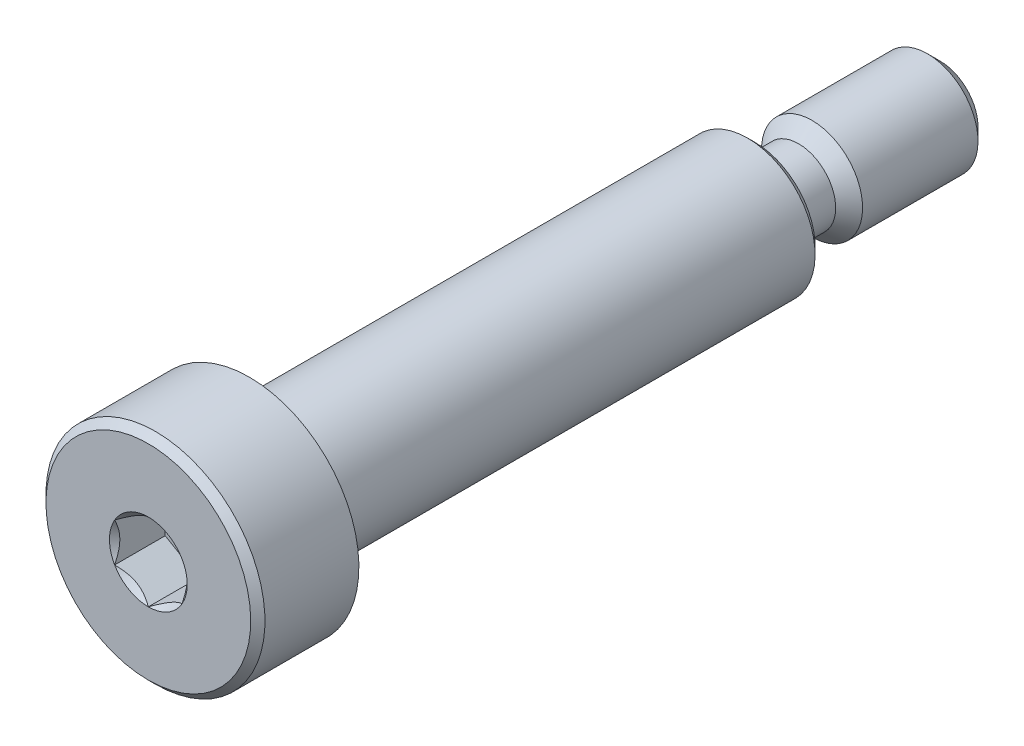
ISO-10303-21;
HEADER;
FILE_DESCRIPTION(('STEP AP214'),'2;1');
FILE_NAME('part.step','',(''),(''),'','','');
FILE_SCHEMA(('AUTOMOTIVE_DESIGN { 1 0 10303 214 1 1 1 1 }'));
ENDSEC;
DATA;
#1=APPLICATION_CONTEXT('core data for automotive mechanical design processes');
#2=APPLICATION_PROTOCOL_DEFINITION('international standard','automotive_design',2000,#1);
#3=PRODUCT_CONTEXT('',#1,'mechanical');
#4=PRODUCT('Part','Part','',(#3));
#5=PRODUCT_RELATED_PRODUCT_CATEGORY('part','',(#4));
#6=PRODUCT_DEFINITION_FORMATION('','',#4);
#7=PRODUCT_DEFINITION_CONTEXT('part definition',#1,'design');
#8=PRODUCT_DEFINITION('design','',#6,#7);
#9=PRODUCT_DEFINITION_SHAPE('','',#8);
#10=(LENGTH_UNIT() NAMED_UNIT(*) SI_UNIT(.MILLI.,.METRE.));
#11=(NAMED_UNIT(*) PLANE_ANGLE_UNIT() SI_UNIT($,.RADIAN.));
#12=(NAMED_UNIT(*) SI_UNIT($,.STERADIAN.) SOLID_ANGLE_UNIT());
#13=UNCERTAINTY_MEASURE_WITH_UNIT(LENGTH_MEASURE(1.E-05),#10,'distance_accuracy_value','');
#14=(GEOMETRIC_REPRESENTATION_CONTEXT(3) GLOBAL_UNCERTAINTY_ASSIGNED_CONTEXT((#13)) GLOBAL_UNIT_ASSIGNED_CONTEXT((#10,
#11,#12)) REPRESENTATION_CONTEXT('',''));
#15=CARTESIAN_POINT('',(0.,0.,0.));
#16=DIRECTION('',(0.,0.,1.));
#17=DIRECTION('',(1.,0.,0.));
#18=AXIS2_PLACEMENT_3D('',#15,#16,#17);
#19=CARTESIAN_POINT('',(0.,0.,-23.5));
#20=DIRECTION('',(0.,0.,-1.));
#21=DIRECTION('',(0.,1.,0.));
#22=AXIS2_PLACEMENT_3D('',#19,#20,#21);
#23=CYLINDRICAL_SURFACE('',#22,4.);
#24=CARTESIAN_POINT('',(0.,0.,-12.0775));
#25=DIRECTION('',(0.,0.,-1.));
#26=DIRECTION('',(0.,1.,0.));
#27=AXIS2_PLACEMENT_3D('',#24,#25,#26);
#28=CIRCLE('',#27,4.);
#29=CARTESIAN_POINT('',(0.,4.,-12.0775));
#30=VERTEX_POINT('',#29);
#31=EDGE_CURVE('E264',#30,#30,#28,.F.);
#32=ORIENTED_EDGE('',*,*,#31,.T.);
#33=EDGE_LOOP('',(#32));
#34=FACE_BOUND('',#33,.T.);
#35=CARTESIAN_POINT('',(0.,0.,16.3733333333333));
#36=DIRECTION('',(0.,0.,-1.));
#37=DIRECTION('',(0.,1.,0.));
#38=AXIS2_PLACEMENT_3D('',#35,#36,#37);
#39=CIRCLE('',#38,4.);
#40=CARTESIAN_POINT('',(0.,4.,16.3733333333333));
#41=VERTEX_POINT('',#40);
#42=EDGE_CURVE('E292',#41,#41,#39,.T.);
#43=ORIENTED_EDGE('',*,*,#42,.T.);
#44=EDGE_LOOP('',(#43));
#45=FACE_BOUND('',#44,.T.);
#46=ADVANCED_FACE('F47',(#34,#45),#23,.T.);
#47=CARTESIAN_POINT('',(0.,-4.,-12.5));
#48=DIRECTION('',(0.,0.,-1.));
#49=DIRECTION('',(0.,1.,0.));
#50=AXIS2_PLACEMENT_3D('',#47,#48,#49);
#51=PLANE('',#50);
#52=CARTESIAN_POINT('',(0.,0.,-12.5));
#53=DIRECTION('',(0.,0.,-1.));
#54=DIRECTION('',(0.,1.,0.));
#55=AXIS2_PLACEMENT_3D('',#52,#53,#54);
#56=CIRCLE('',#55,3.57750000000001);
#57=CARTESIAN_POINT('',(0.,3.57750000000001,-12.5));
#58=VERTEX_POINT('',#57);
#59=EDGE_CURVE('E267',#58,#58,#56,.T.);
#60=ORIENTED_EDGE('',*,*,#59,.T.);
#61=EDGE_LOOP('',(#60));
#62=FACE_BOUND('',#61,.T.);
#63=CARTESIAN_POINT('',(0.,0.,-12.5));
#64=DIRECTION('',(0.,0.,-1.));
#65=DIRECTION('',(0.,1.,0.));
#66=AXIS2_PLACEMENT_3D('',#63,#64,#65);
#67=CIRCLE('',#66,3.);
#68=CARTESIAN_POINT('',(0.,3.,-12.5));
#69=VERTEX_POINT('',#68);
#70=EDGE_CURVE('E318',#69,#69,#67,.T.);
#71=ORIENTED_EDGE('',*,*,#70,.F.);
#72=EDGE_LOOP('',(#71));
#73=FACE_BOUND('',#72,.T.);
#74=ADVANCED_FACE('F217',(#62,#73),#51,.T.);
#75=CARTESIAN_POINT('',(0.,0.,-23.5));
#76=DIRECTION('',(0.,0.,-1.));
#77=DIRECTION('',(0.,1.,0.));
#78=AXIS2_PLACEMENT_3D('',#75,#76,#77);
#79=CYLINDRICAL_SURFACE('',#78,3.13333333333333);
#80=CARTESIAN_POINT('',(0.,0.,16.8933333333333));
#81=DIRECTION('',(0.,0.,-1.));
#82=DIRECTION('',(0.,1.,0.));
#83=AXIS2_PLACEMENT_3D('',#80,#81,#82);
#84=CIRCLE('',#83,3.13333333333333);
#85=CARTESIAN_POINT('',(0.,3.13333333333333,16.8933333333333));
#86=VERTEX_POINT('',#85);
#87=EDGE_CURVE('E312',#86,#86,#84,.F.);
#88=ORIENTED_EDGE('',*,*,#87,.T.);
#89=EDGE_LOOP('',(#88));
#90=FACE_BOUND('',#89,.T.);
#91=CARTESIAN_POINT('',(0.,0.,17.5));
#92=DIRECTION('',(0.,0.,-1.));
#93=DIRECTION('',(0.,1.,0.));
#94=AXIS2_PLACEMENT_3D('',#91,#92,#93);
#95=CIRCLE('',#94,3.13333333333333);
#96=CARTESIAN_POINT('',(0.,3.13333333333333,17.5));
#97=VERTEX_POINT('',#96);
#98=EDGE_CURVE('E293',#97,#97,#95,.T.);
#99=ORIENTED_EDGE('',*,*,#98,.T.);
#100=EDGE_LOOP('',(#99));
#101=FACE_BOUND('',#100,.T.);
#102=ADVANCED_FACE('F224',(#90,#101),#79,.T.);
#103=CARTESIAN_POINT('',(0.,3.99999999999999,16.6333333333333));
#104=DIRECTION('',(0.,0.,-1.));
#105=DIRECTION('',(0.,1.,0.));
#106=AXIS2_PLACEMENT_3D('',#103,#104,#105);
#107=PLANE('',#106);
#108=CARTESIAN_POINT('',(0.,0.,16.6333333333333));
#109=DIRECTION('',(0.,0.,-1.));
#110=DIRECTION('',(0.,1.,0.));
#111=AXIS2_PLACEMENT_3D('',#108,#109,#110);
#112=CIRCLE('',#111,3.74000000000001);
#113=CARTESIAN_POINT('',(0.,3.74,16.6333333333333));
#114=VERTEX_POINT('',#113);
#115=EDGE_CURVE('E308',#114,#114,#112,.F.);
#116=ORIENTED_EDGE('',*,*,#115,.T.);
#117=EDGE_LOOP('',(#116));
#118=FACE_BOUND('',#117,.T.);
#119=CARTESIAN_POINT('',(0.,0.,16.6333333333333));
#120=DIRECTION('',(0.,0.,-1.));
#121=DIRECTION('',(0.,1.,0.));
#122=AXIS2_PLACEMENT_3D('',#119,#120,#121);
#123=CIRCLE('',#122,3.39333333333332);
#124=CARTESIAN_POINT('',(0.,3.39333333333331,16.6333333333333));
#125=VERTEX_POINT('',#124);
#126=EDGE_CURVE('E298',#125,#125,#123,.T.);
#127=ORIENTED_EDGE('',*,*,#126,.T.);
#128=EDGE_LOOP('',(#127));
#129=FACE_BOUND('',#128,.T.);
#130=ADVANCED_FACE('F242',(#118,#129),#107,.F.);
#131=CARTESIAN_POINT('',(0.,0.,23.5));
#132=DIRECTION('',(0.,0.,1.));
#133=DIRECTION('',(0.,-1.,0.));
#134=AXIS2_PLACEMENT_3D('',#131,#132,#133);
#135=PLANE('',#134);
#136=CARTESIAN_POINT('',(0.,0.,23.5));
#137=DIRECTION('',(0.,0.,1.));
#138=DIRECTION('',(1.,0.,0.));
#139=AXIS2_PLACEMENT_3D('',#136,#137,#138);
#140=CIRCLE('',#139,2.3094010767585);
#141=CARTESIAN_POINT('',(0.,-2.30940107675851,23.5));
#142=VERTEX_POINT('',#141);
#143=CARTESIAN_POINT('',(2.,-1.15470053837926,23.5));
#144=VERTEX_POINT('',#143);
#145=EDGE_CURVE('E68',#142,#144,#140,.T.);
#146=ORIENTED_EDGE('',*,*,#145,.F.);
#147=CARTESIAN_POINT('',(-2.,-1.15470053837926,23.5));
#148=VERTEX_POINT('',#147);
#149=EDGE_CURVE('E75',#148,#142,#140,.T.);
#150=ORIENTED_EDGE('',*,*,#149,.F.);
#151=CARTESIAN_POINT('',(-2.,1.15470053837925,23.5));
#152=VERTEX_POINT('',#151);
#153=EDGE_CURVE('E155',#152,#148,#140,.T.);
#154=ORIENTED_EDGE('',*,*,#153,.F.);
#155=CARTESIAN_POINT('',(0.,2.3094010767585,23.5));
#156=VERTEX_POINT('',#155);
#157=EDGE_CURVE('E147',#156,#152,#140,.T.);
#158=ORIENTED_EDGE('',*,*,#157,.F.);
#159=CARTESIAN_POINT('',(2.,1.15470053837924,23.5));
#160=VERTEX_POINT('',#159);
#161=EDGE_CURVE('E117',#160,#156,#140,.T.);
#162=ORIENTED_EDGE('',*,*,#161,.F.);
#163=EDGE_CURVE('E107',#144,#160,#140,.T.);
#164=ORIENTED_EDGE('',*,*,#163,.F.);
#165=EDGE_LOOP('',(#146,#150,#154,#158,#162,#164));
#166=FACE_BOUND('',#165,.T.);
#167=CARTESIAN_POINT('',(0.,0.,23.5));
#168=DIRECTION('',(0.,0.,1.));
#169=DIRECTION('',(0.,-1.,0.));
#170=AXIS2_PLACEMENT_3D('',#167,#168,#169);
#171=CIRCLE('',#170,6.07749999999999);
#172=CARTESIAN_POINT('',(0.,-6.0775,23.5));
#173=VERTEX_POINT('',#172);
#174=EDGE_CURVE('E62',#173,#173,#171,.T.);
#175=ORIENTED_EDGE('',*,*,#174,.T.);
#176=EDGE_LOOP('',(#175));
#177=FACE_BOUND('',#176,.T.);
#178=ADVANCED_FACE('F144',(#166,#177),#135,.T.);
#179=CARTESIAN_POINT('',(0.,0.,-23.5));
#180=DIRECTION('',(0.,0.,-1.));
#181=DIRECTION('',(0.,1.,0.));
#182=AXIS2_PLACEMENT_3D('',#179,#180,#181);
#183=CYLINDRICAL_SURFACE('',#182,6.5);
#184=CARTESIAN_POINT('',(0.,0.,23.0775));
#185=DIRECTION('',(0.,0.,1.));
#186=DIRECTION('',(0.,-1.,0.));
#187=AXIS2_PLACEMENT_3D('',#184,#185,#186);
#188=CIRCLE('',#187,6.5);
#189=CARTESIAN_POINT('',(0.,-6.50000000000001,23.0775));
#190=VERTEX_POINT('',#189);
#191=EDGE_CURVE('E273',#190,#190,#188,.F.);
#192=ORIENTED_EDGE('',*,*,#191,.T.);
#193=EDGE_LOOP('',(#192));
#194=FACE_BOUND('',#193,.T.);
#195=CARTESIAN_POINT('',(0.,0.,17.5));
#196=DIRECTION('',(0.,0.,-1.));
#197=DIRECTION('',(0.,1.,0.));
#198=AXIS2_PLACEMENT_3D('',#195,#196,#197);
#199=CIRCLE('',#198,6.5);
#200=CARTESIAN_POINT('',(0.,6.5,17.5));
#201=VERTEX_POINT('',#200);
#202=EDGE_CURVE('E290',#201,#201,#199,.T.);
#203=ORIENTED_EDGE('',*,*,#202,.F.);
#204=EDGE_LOOP('',(#203));
#205=FACE_BOUND('',#204,.T.);
#206=ADVANCED_FACE('F235',(#194,#205),#183,.T.);
#207=CARTESIAN_POINT('',(0.,-6.5,17.5));
#208=DIRECTION('',(0.,0.,-1.));
#209=DIRECTION('',(0.,1.,0.));
#210=AXIS2_PLACEMENT_3D('',#207,#208,#209);
#211=PLANE('',#210);
#212=ORIENTED_EDGE('',*,*,#202,.T.);
#213=EDGE_LOOP('',(#212));
#214=FACE_BOUND('',#213,.T.);
#215=ORIENTED_EDGE('',*,*,#98,.F.);
#216=EDGE_LOOP('',(#215));
#217=FACE_BOUND('',#216,.T.);
#218=ADVANCED_FACE('F231',(#214,#217),#211,.T.);
#219=CARTESIAN_POINT('',(0.,0.,16.3733333333333));
#220=DIRECTION('',(0.,0.,-1.));
#221=DIRECTION('',(0.,1.,0.));
#222=AXIS2_PLACEMENT_3D('',#219,#220,#221);
#223=CONICAL_SURFACE('',#222,4.,0.785398163397442);
#224=ORIENTED_EDGE('',*,*,#115,.F.);
#225=EDGE_LOOP('',(#224));
#226=FACE_BOUND('',#225,.T.);
#227=ORIENTED_EDGE('',*,*,#42,.F.);
#228=EDGE_LOOP('',(#227));
#229=FACE_BOUND('',#228,.T.);
#230=ADVANCED_FACE('F234',(#226,#229),#223,.T.);
#231=CARTESIAN_POINT('',(0.,0.,16.6333333333333));
#232=DIRECTION('',(0.,0.,-1.));
#233=DIRECTION('',(0.,1.,0.));
#234=AXIS2_PLACEMENT_3D('',#231,#232,#233);
#235=CONICAL_SURFACE('',#234,3.39333333333332,0.785398163397454);
#236=ORIENTED_EDGE('',*,*,#87,.F.);
#237=EDGE_LOOP('',(#236));
#238=FACE_BOUND('',#237,.T.);
#239=ORIENTED_EDGE('',*,*,#126,.F.);
#240=EDGE_LOOP('',(#239));
#241=FACE_BOUND('',#240,.T.);
#242=ADVANCED_FACE('F245',(#238,#241),#235,.T.);
#243=CARTESIAN_POINT('',(0.,0.,-13.3));
#244=DIRECTION('',(0.,0.,-1.));
#245=DIRECTION('',(0.,1.,0.));
#246=AXIS2_PLACEMENT_3D('',#243,#244,#245);
#247=TOROIDAL_SURFACE('',#246,3.,0.800000000000007);
#248=CARTESIAN_POINT('',(0.,0.,-13.3));
#249=DIRECTION('',(0.,0.,-1.));
#250=DIRECTION('',(0.,1.,0.));
#251=AXIS2_PLACEMENT_3D('',#248,#249,#250);
#252=CIRCLE('',#251,2.2);
#253=CARTESIAN_POINT('',(0.,2.2,-13.3));
#254=VERTEX_POINT('',#253);
#255=EDGE_CURVE('E396',#254,#254,#252,.T.);
#256=ORIENTED_EDGE('',*,*,#255,.F.);
#257=EDGE_LOOP('',(#256));
#258=FACE_BOUND('',#257,.T.);
#259=ORIENTED_EDGE('',*,*,#70,.T.);
#260=EDGE_LOOP('',(#259));
#261=FACE_BOUND('',#260,.T.);
#262=ADVANCED_FACE('F249',(#258,#261),#247,.F.);
#263=CARTESIAN_POINT('',(0.,0.,-23.5));
#264=DIRECTION('',(0.,0.,-1.));
#265=DIRECTION('',(0.,1.,0.));
#266=AXIS2_PLACEMENT_3D('',#263,#264,#265);
#267=CYLINDRICAL_SURFACE('',#266,2.2);
#268=CARTESIAN_POINT('',(0.,0.,-15.1));
#269=DIRECTION('',(0.,0.,-1.));
#270=DIRECTION('',(0.,1.,0.));
#271=AXIS2_PLACEMENT_3D('',#268,#269,#270);
#272=CIRCLE('',#271,2.2);
#273=CARTESIAN_POINT('',(0.,2.2,-15.1));
#274=VERTEX_POINT('',#273);
#275=EDGE_CURVE('E380',#274,#274,#272,.T.);
#276=ORIENTED_EDGE('',*,*,#275,.F.);
#277=EDGE_LOOP('',(#276));
#278=FACE_BOUND('',#277,.T.);
#279=ORIENTED_EDGE('',*,*,#255,.T.);
#280=EDGE_LOOP('',(#279));
#281=FACE_BOUND('',#280,.T.);
#282=ADVANCED_FACE('F333',(#278,#281),#267,.T.);
#283=CARTESIAN_POINT('',(0.,0.,-15.1));
#284=DIRECTION('',(0.,0.,-1.));
#285=DIRECTION('',(0.,1.,0.));
#286=AXIS2_PLACEMENT_3D('',#283,#284,#285);
#287=CONICAL_SURFACE('',#286,2.2,0.785398163397442);
#288=CARTESIAN_POINT('',(0.,0.,-15.9));
#289=DIRECTION('',(0.,0.,-1.));
#290=DIRECTION('',(0.,1.,0.));
#291=AXIS2_PLACEMENT_3D('',#288,#289,#290);
#292=CIRCLE('',#291,3.);
#293=CARTESIAN_POINT('',(0.,3.,-15.9));
#294=VERTEX_POINT('',#293);
#295=EDGE_CURVE('E301',#294,#294,#292,.F.);
#296=ORIENTED_EDGE('',*,*,#295,.T.);
#297=EDGE_LOOP('',(#296));
#298=FACE_BOUND('',#297,.T.);
#299=ORIENTED_EDGE('',*,*,#275,.T.);
#300=EDGE_LOOP('',(#299));
#301=FACE_BOUND('',#300,.T.);
#302=ADVANCED_FACE('F326',(#298,#301),#287,.T.);
#303=CARTESIAN_POINT('',(0.,-3.,-23.5));
#304=DIRECTION('',(0.,0.,-1.));
#305=DIRECTION('',(0.,1.,0.));
#306=AXIS2_PLACEMENT_3D('',#303,#304,#305);
#307=PLANE('',#306);
#308=CARTESIAN_POINT('',(0.,0.,-23.5));
#309=DIRECTION('',(0.,0.,-1.));
#310=DIRECTION('',(0.,1.,0.));
#311=AXIS2_PLACEMENT_3D('',#308,#309,#310);
#312=CIRCLE('',#311,2.25);
#313=CARTESIAN_POINT('',(0.,2.25,-23.5));
#314=VERTEX_POINT('',#313);
#315=EDGE_CURVE('E276',#314,#314,#312,.T.);
#316=ORIENTED_EDGE('',*,*,#315,.T.);
#317=EDGE_LOOP('',(#316));
#318=FACE_BOUND('',#317,.T.);
#319=ADVANCED_FACE('F323',(#318),#307,.T.);
#320=CARTESIAN_POINT('',(0.,0.,-23.5));
#321=DIRECTION('',(0.,0.,-1.));
#322=DIRECTION('',(0.,1.,0.));
#323=AXIS2_PLACEMENT_3D('',#320,#321,#322);
#324=CYLINDRICAL_SURFACE('',#323,3.);
#325=CARTESIAN_POINT('',(0.,0.,-22.75));
#326=DIRECTION('',(0.,0.,-1.));
#327=DIRECTION('',(0.,1.,0.));
#328=AXIS2_PLACEMENT_3D('',#325,#326,#327);
#329=CIRCLE('',#328,3.);
#330=CARTESIAN_POINT('',(0.,3.,-22.75));
#331=VERTEX_POINT('',#330);
#332=EDGE_CURVE('E269',#331,#331,#329,.F.);
#333=ORIENTED_EDGE('',*,*,#332,.T.);
#334=EDGE_LOOP('',(#333));
#335=FACE_BOUND('',#334,.T.);
#336=ORIENTED_EDGE('',*,*,#295,.F.);
#337=EDGE_LOOP('',(#336));
#338=FACE_BOUND('',#337,.T.);
#339=ADVANCED_FACE('F254',(#335,#338),#324,.T.);
#340=CARTESIAN_POINT('',(0.,0.,-23.5));
#341=DIRECTION('',(0.,0.,1.));
#342=DIRECTION('',(0.,-1.,0.));
#343=AXIS2_PLACEMENT_3D('',#340,#341,#342);
#344=CONICAL_SURFACE('',#343,2.24999999999999,0.785398163397451);
#345=ORIENTED_EDGE('',*,*,#332,.F.);
#346=EDGE_LOOP('',(#345));
#347=FACE_BOUND('',#346,.T.);
#348=ORIENTED_EDGE('',*,*,#315,.F.);
#349=EDGE_LOOP('',(#348));
#350=FACE_BOUND('',#349,.T.);
#351=ADVANCED_FACE('F251',(#347,#350),#344,.T.);
#352=CARTESIAN_POINT('',(0.,0.,-12.5));
#353=DIRECTION('',(0.,0.,1.));
#354=DIRECTION('',(0.,-1.,0.));
#355=AXIS2_PLACEMENT_3D('',#352,#353,#354);
#356=CONICAL_SURFACE('',#355,3.57750000000001,0.78539816339745);
#357=ORIENTED_EDGE('',*,*,#31,.F.);
#358=EDGE_LOOP('',(#357));
#359=FACE_BOUND('',#358,.T.);
#360=ORIENTED_EDGE('',*,*,#59,.F.);
#361=EDGE_LOOP('',(#360));
#362=FACE_BOUND('',#361,.T.);
#363=ADVANCED_FACE('F253',(#359,#362),#356,.T.);
#364=CARTESIAN_POINT('',(0.,0.,23.0775));
#365=DIRECTION('',(0.,0.,-1.));
#366=DIRECTION('',(0.,1.,0.));
#367=AXIS2_PLACEMENT_3D('',#364,#365,#366);
#368=CONICAL_SURFACE('',#367,6.5,0.785398163397451);
#369=ORIENTED_EDGE('',*,*,#174,.F.);
#370=EDGE_LOOP('',(#369));
#371=FACE_BOUND('',#370,.T.);
#372=ORIENTED_EDGE('',*,*,#191,.F.);
#373=EDGE_LOOP('',(#372));
#374=FACE_BOUND('',#373,.T.);
#375=ADVANCED_FACE('F49',(#371,#374),#368,.T.);
#376=CARTESIAN_POINT('',(0.,0.,23.5));
#377=DIRECTION('',(0.,0.,1.));
#378=DIRECTION('',(1.,0.,0.));
#379=AXIS2_PLACEMENT_3D('',#376,#377,#378);
#380=CONICAL_SURFACE('',#379,2.3094010767585,0.78539816339745);
#381=ORIENTED_EDGE('',*,*,#161,.T.);
#382=CARTESIAN_POINT('',(2.0002,1.15458506832541,23.5001154787136));
#383=CARTESIAN_POINT('',(1.93144696596929,1.19427965103064,23.4604530902256));
#384=CARTESIAN_POINT('',(1.86154425786449,1.23463799837203,23.4231199822842));
#385=CARTESIAN_POINT('',(1.71900475544956,1.31693321846145,23.3547636851361));
#386=CARTESIAN_POINT('',(1.64635440243464,1.35887791933133,23.3237785337372));
#387=CARTESIAN_POINT('',(1.49985839894603,1.44345742638069,23.2707002165441));
#388=CARTESIAN_POINT('',(1.42605006475371,1.48607068799506,23.2484736271766));
#389=CARTESIAN_POINT('',(1.27680836816474,1.57223542169502,23.2142288166751));
#390=CARTESIAN_POINT('',(1.20137956608185,1.61578426088223,23.2021850291441));
#391=CARTESIAN_POINT('',(1.07138449932892,1.69083694766535,23.1913185119056));
#392=CARTESIAN_POINT('',(1.01698621602989,1.7222438111715,23.18970975361));
#393=CARTESIAN_POINT('',(0.908278544480307,1.78500621460363,23.1924188775987));
#394=CARTESIAN_POINT('',(0.853969194078662,1.81636173267753,23.196738837758));
#395=CARTESIAN_POINT('',(0.745863272410663,1.87877671565355,23.2110595674099));
#396=CARTESIAN_POINT('',(0.692067343445209,1.90983580972306,23.221066692762));
#397=CARTESIAN_POINT('',(0.585405737694428,1.97141691651547,23.2462124302496));
#398=CARTESIAN_POINT('',(0.532539989929289,2.00193897021858,23.2613506490422));
#399=CARTESIAN_POINT('',(0.397120266910157,2.08012358375726,23.3062945034292));
#400=CARTESIAN_POINT('',(0.315406165150521,2.12730124240478,23.3394888394258));
#401=CARTESIAN_POINT('',(0.195252962742198,2.19667172615922,23.3955258231714));
#402=CARTESIAN_POINT('',(0.155657147890824,2.21953238052244,23.4152147029469));
#403=CARTESIAN_POINT('',(0.0771990411121299,2.26483018959123,23.4563873183649));
#404=CARTESIAN_POINT('',(0.0383363164062617,2.2872675941616,23.4778699516512));
#405=CARTESIAN_POINT('',(-0.000199999999998804,2.30951654681234,23.5001154787136));
#406=B_SPLINE_CURVE_WITH_KNOTS('',3,(#382,#383,#384,#385,#386,#387,#388,#389,#390,#391,#392,
#393,#394,#395,#396,#397,#398,#399,#400,#401,#402,#403,#404,#405),.UNSPECIFIED.,.F.,.F.,(4,2,2,
2,2,2,2,2,2,2,2,4),(0.,0.266420613771065,0.53439375152339,0.798110374376914,1.06116288956936,
1.24939906803722,1.43770123566247,1.62621426093932,1.81471283831913,2.11415604834145,
2.2634717071779,2.41269626969771),.UNSPECIFIED.);
#407=EDGE_CURVE('E11',#160,#156,#406,.T.);
#408=ORIENTED_EDGE('',*,*,#407,.F.);
#409=EDGE_LOOP('',(#381,#408));
#410=FACE_BOUND('',#409,.T.);
#411=ADVANCED_FACE('F120',(#410),#380,.F.);
#412=ORIENTED_EDGE('',*,*,#157,.T.);
#413=CARTESIAN_POINT('',(0.000199999999999603,2.30951654681234,23.5001154787136));
#414=CARTESIAN_POINT('',(-0.0685530340307061,2.2698219641071,23.4604530902256));
#415=CARTESIAN_POINT('',(-0.138455742135512,2.22946361676571,23.4231199822841));
#416=CARTESIAN_POINT('',(-0.280995244550438,2.1471683966763,23.3547636851361));
#417=CARTESIAN_POINT('',(-0.353645597565359,2.10522369580641,23.3237785337372));
#418=CARTESIAN_POINT('',(-0.500141601053972,2.02064418875706,23.2707002165441));
#419=CARTESIAN_POINT('',(-0.573949935246295,1.97803092714268,23.2484736271766));
#420=CARTESIAN_POINT('',(-0.723191631835264,1.89186619344272,23.2142288166751));
#421=CARTESIAN_POINT('',(-0.798620433918152,1.84831735425552,23.2021850291441));
#422=CARTESIAN_POINT('',(-0.928615500671079,1.77326466747239,23.1913185119056));
#423=CARTESIAN_POINT('',(-0.983013783970109,1.74185780396624,23.18970975361));
#424=CARTESIAN_POINT('',(-1.09172145551969,1.67909540053411,23.1924188775987));
#425=CARTESIAN_POINT('',(-1.14603080592134,1.64773988246021,23.196738837758));
#426=CARTESIAN_POINT('',(-1.25413672758934,1.5853248994842,23.2110595674099));
#427=CARTESIAN_POINT('',(-1.30793265655479,1.55426580541469,23.221066692762));
#428=CARTESIAN_POINT('',(-1.41459426230557,1.49268469862228,23.2462124302496));
#429=CARTESIAN_POINT('',(-1.46746001007071,1.46216264491916,23.2613506490422));
#430=CARTESIAN_POINT('',(-1.60287973308984,1.38397803138048,23.3062945034292));
#431=CARTESIAN_POINT('',(-1.68459383484948,1.33680037273297,23.3394888394258));
#432=CARTESIAN_POINT('',(-1.8047470372578,1.26742988897853,23.3955258231714));
#433=CARTESIAN_POINT('',(-1.84434285210918,1.2445692346153,23.4152147029469));
#434=CARTESIAN_POINT('',(-1.92280095888787,1.19927142554651,23.4563873183649));
#435=CARTESIAN_POINT('',(-1.96166368359374,1.17683402097614,23.4778699516512));
#436=CARTESIAN_POINT('',(-2.0002,1.15458506832541,23.5001154787136));
#437=B_SPLINE_CURVE_WITH_KNOTS('',3,(#413,#414,#415,#416,#417,#418,#419,#420,#421,#422,#423,
#424,#425,#426,#427,#428,#429,#430,#431,#432,#433,#434,#435,#436),.UNSPECIFIED.,.F.,.F.,(4,2,2,
2,2,2,2,2,2,2,2,4),(0.,0.266420613771065,0.534393751523388,0.798110374376912,1.06116288956936,
1.24939906803721,1.43770123566247,1.62621426093931,1.81471283831913,2.11415604834144,
2.26347170717791,2.41269626969771),.UNSPECIFIED.);
#438=EDGE_CURVE('E149',#156,#152,#437,.T.);
#439=ORIENTED_EDGE('',*,*,#438,.F.);
#440=EDGE_LOOP('',(#412,#439));
#441=FACE_BOUND('',#440,.T.);
#442=ADVANCED_FACE('F424',(#441),#380,.F.);
#443=ORIENTED_EDGE('',*,*,#153,.T.);
#444=CARTESIAN_POINT('',(-2.,-2.30294417292924,24.2407713550277));
#445=CARTESIAN_POINT('',(-2.,-2.24687002663713,24.198443273626));
#446=CARTESIAN_POINT('',(-2.,-2.1904819053696,24.1565251568643));
#447=CARTESIAN_POINT('',(-2.,-2.07695390496425,24.073690417861));
#448=CARTESIAN_POINT('',(-2.,-2.01981384066455,24.0327740496681));
#449=CARTESIAN_POINT('',(-2.,-1.90424016804776,23.9518334520186));
#450=CARTESIAN_POINT('',(-2.,-1.84579996743911,23.9118185915599));
#451=CARTESIAN_POINT('',(-2.,-1.72792745461761,23.8332889936643));
#452=CARTESIAN_POINT('',(-2.,-1.66849521292324,23.7947741502431));
#453=CARTESIAN_POINT('',(-2.,-1.4816299571002,23.6776406516043));
#454=CARTESIAN_POINT('',(-2.,-1.35220318163537,23.6021459017296));
#455=CARTESIAN_POINT('',(-2.,-1.08689521592925,23.4640493509944));
#456=CARTESIAN_POINT('',(-2.,-0.951037763938196,23.4014040859035));
#457=CARTESIAN_POINT('',(-2.,-0.747111912259412,23.3247635438751));
#458=CARTESIAN_POINT('',(-2.,-0.682064034147879,23.3027671799191));
#459=CARTESIAN_POINT('',(-2.,-0.550398103294756,23.2639966876601));
#460=CARTESIAN_POINT('',(-2.,-0.483779942722479,23.2472229191212));
#461=CARTESIAN_POINT('',(-2.,-0.350484328847658,23.2200482578844));
#462=CARTESIAN_POINT('',(-2.,-0.283829489364789,23.2095381767417));
#463=CARTESIAN_POINT('',(-2.,-0.14980698713938,23.1950960855449));
#464=CARTESIAN_POINT('',(-2.,-0.0824394489341258,23.1911629447331));
#465=CARTESIAN_POINT('',(-2.,0.0499055622944859,23.1901664769337));
#466=CARTESIAN_POINT('',(-2.,0.114881285143169,23.1928596448504));
#467=CARTESIAN_POINT('',(-2.,0.244275921482757,23.2044300704227));
#468=CARTESIAN_POINT('',(-2.,0.30869478026675,23.2133079288332));
#469=CARTESIAN_POINT('',(-2.,0.437599788610702,23.2369136592961));
#470=CARTESIAN_POINT('',(-2.,0.502067428644593,23.2517410834465));
#471=CARTESIAN_POINT('',(-2.,0.629594322598304,23.286457883628));
#472=CARTESIAN_POINT('',(-2.,0.692653693883148,23.3063468361063));
#473=CARTESIAN_POINT('',(-2.,0.891187889210543,23.3764469792562));
#474=CARTESIAN_POINT('',(-2.,1.02383545707306,23.4346418003215));
#475=CARTESIAN_POINT('',(-2.,1.28290932150074,23.5640305754596));
#476=CARTESIAN_POINT('',(-2.,1.4093111258757,23.6352712314148));
#477=CARTESIAN_POINT('',(-2.,1.59200441438963,23.7464419918747));
#478=CARTESIAN_POINT('',(-2.,1.65027549026191,23.7831821903374));
#479=CARTESIAN_POINT('',(-2.,1.76581760389242,23.8582145141838));
#480=CARTESIAN_POINT('',(-2.,1.82308856543104,23.896506757118));
#481=CARTESIAN_POINT('',(-2.,1.93629654762084,23.9740422640812));
#482=CARTESIAN_POINT('',(-2.,1.99224062500538,24.0132752761336));
#483=CARTESIAN_POINT('',(-2.,2.103364240299,24.0927788307365));
#484=CARTESIAN_POINT('',(-2.,2.15854398422468,24.1330490850006));
#485=CARTESIAN_POINT('',(-2.,2.21340370692658,24.1737442381459));
#486=B_SPLINE_CURVE_WITH_KNOTS('',3,(#444,#445,#446,#447,#448,#449,#450,#451,#452,#453,#454,
#455,#456,#457,#458,#459,#460,#461,#462,#463,#464,#465,#466,#467,#468,#469,#470,#471,#472,#473,
#474,#475,#476,#477,#478,#479,#480,#481,#482,#483,#484,#485),.UNSPECIFIED.,.F.,.F.,(4,2,2,2,2,2,
2,2,2,2,2,2,2,2,2,2,2,2,2,2,4),(0.,0.210772731976888,0.421598374658587,0.634057554623486,
0.846501695870169,1.29562155455624,1.74319622821645,1.94902062110208,2.15485918928326,
2.35699582502635,2.5590977043214,2.75388435553556,2.94868993014815,3.14690093452586,
3.34509535789702,3.77838155837654,4.21325029921625,4.41989056685647,4.62654651460921,
4.8315237711129,5.03644465914085),.UNSPECIFIED.);
#487=EDGE_CURVE('E153',#152,#148,#486,.F.);
#488=ORIENTED_EDGE('',*,*,#487,.F.);
#489=EDGE_LOOP('',(#443,#488));
#490=FACE_BOUND('',#489,.T.);
#491=ADVANCED_FACE('F419',(#490),#380,.F.);
#492=ORIENTED_EDGE('',*,*,#149,.T.);
#493=CARTESIAN_POINT('',(-2.0002,-1.15458506832542,23.5001154787136));
#494=CARTESIAN_POINT('',(-1.93144696596929,-1.19427965103065,23.4604530902256));
#495=CARTESIAN_POINT('',(-1.86154425786449,-1.23463799837204,23.4231199822842));
#496=CARTESIAN_POINT('',(-1.71900475544956,-1.31693321846146,23.3547636851361));
#497=CARTESIAN_POINT('',(-1.64635440243464,-1.35887791933134,23.3237785337372));
#498=CARTESIAN_POINT('',(-1.49985839894603,-1.4434574263807,23.2707002165441));
#499=CARTESIAN_POINT('',(-1.42605006475371,-1.48607068799507,23.2484736271766));
#500=CARTESIAN_POINT('',(-1.27680836816474,-1.57223542169503,23.2142288166751));
#501=CARTESIAN_POINT('',(-1.20137956608185,-1.61578426088224,23.2021850291441));
#502=CARTESIAN_POINT('',(-1.07138449932892,-1.69083694766536,23.1913185119056));
#503=CARTESIAN_POINT('',(-1.01698621602989,-1.72224381117151,23.18970975361));
#504=CARTESIAN_POINT('',(-0.908278544480308,-1.78500621460364,23.1924188775987));
#505=CARTESIAN_POINT('',(-0.853969194078663,-1.81636173267754,23.196738837758));
#506=CARTESIAN_POINT('',(-0.745863272410663,-1.87877671565356,23.2110595674099));
#507=CARTESIAN_POINT('',(-0.692067343445209,-1.90983580972307,23.221066692762));
#508=CARTESIAN_POINT('',(-0.585405737694428,-1.97141691651548,23.2462124302497));
#509=CARTESIAN_POINT('',(-0.532539989929289,-2.00193897021859,23.2613506490422));
#510=CARTESIAN_POINT('',(-0.397120266910157,-2.08012358375727,23.3062945034292));
#511=CARTESIAN_POINT('',(-0.315406165150523,-2.12730124240479,23.3394888394258));
#512=CARTESIAN_POINT('',(-0.195252962742198,-2.19667172615923,23.3955258231714));
#513=CARTESIAN_POINT('',(-0.155657147890823,-2.21953238052245,23.4152147029469));
#514=CARTESIAN_POINT('',(-0.0771990411121272,-2.26483018959124,23.4563873183649));
#515=CARTESIAN_POINT('',(-0.0383363164062594,-2.28726759416161,23.4778699516512));
#516=CARTESIAN_POINT('',(0.000199999999999116,-2.30951654681235,23.5001154787137));
#517=B_SPLINE_CURVE_WITH_KNOTS('',3,(#493,#494,#495,#496,#497,#498,#499,#500,#501,#502,#503,
#504,#505,#506,#507,#508,#509,#510,#511,#512,#513,#514,#515,#516),.UNSPECIFIED.,.F.,.F.,(4,2,2,
2,2,2,2,2,2,2,2,4),(0.,0.266420613771062,0.534393751523386,0.798110374376911,1.06116288956936,
1.24939906803721,1.43770123566247,1.62621426093931,1.81471283831913,2.11415604834145,
2.2634717071779,2.41269626969771),.UNSPECIFIED.);
#518=EDGE_CURVE('E181',#148,#142,#517,.T.);
#519=ORIENTED_EDGE('',*,*,#518,.F.);
#520=EDGE_LOOP('',(#492,#519));
#521=FACE_BOUND('',#520,.T.);
#522=ADVANCED_FACE('F423',(#521),#380,.F.);
#523=ORIENTED_EDGE('',*,*,#145,.T.);
#524=CARTESIAN_POINT('',(-0.000200000000000863,-2.30951654681235,23.5001154787137));
#525=CARTESIAN_POINT('',(0.068553034030705,-2.26982196410711,23.4604530902256));
#526=CARTESIAN_POINT('',(0.138455742135511,-2.22946361676572,23.4231199822842));
#527=CARTESIAN_POINT('',(0.280995244550436,-2.14716839667631,23.3547636851361));
#528=CARTESIAN_POINT('',(0.353645597565357,-2.10522369580642,23.3237785337372));
#529=CARTESIAN_POINT('',(0.50014160105397,-2.02064418875707,23.2707002165441));
#530=CARTESIAN_POINT('',(0.573949935246293,-1.97803092714269,23.2484736271766));
#531=CARTESIAN_POINT('',(0.723191631835262,-1.89186619344273,23.2142288166751));
#532=CARTESIAN_POINT('',(0.79862043391815,-1.84831735425553,23.2021850291441));
#533=CARTESIAN_POINT('',(0.928615500671077,-1.7732646674724,23.1913185119056));
#534=CARTESIAN_POINT('',(0.983013783970106,-1.74185780396625,23.18970975361));
#535=CARTESIAN_POINT('',(1.09172145551969,-1.67909540053412,23.1924188775987));
#536=CARTESIAN_POINT('',(1.14603080592134,-1.64773988246022,23.196738837758));
#537=CARTESIAN_POINT('',(1.25413672758934,-1.58532489948421,23.2110595674099));
#538=CARTESIAN_POINT('',(1.30793265655479,-1.5542658054147,23.221066692762));
#539=CARTESIAN_POINT('',(1.41459426230557,-1.49268469862229,23.2462124302497));
#540=CARTESIAN_POINT('',(1.46746001007071,-1.46216264491917,23.2613506490422));
#541=CARTESIAN_POINT('',(1.60287973308984,-1.38397803138049,23.3062945034292));
#542=CARTESIAN_POINT('',(1.68459383484948,-1.33680037273298,23.3394888394258));
#543=CARTESIAN_POINT('',(1.8047470372578,-1.26742988897854,23.3955258231714));
#544=CARTESIAN_POINT('',(1.84434285210918,-1.24456923461531,23.4152147029469));
#545=CARTESIAN_POINT('',(1.92280095888787,-1.19927142554653,23.4563873183649));
#546=CARTESIAN_POINT('',(1.96166368359374,-1.17683402097615,23.4778699516512));
#547=CARTESIAN_POINT('',(2.0002,-1.15458506832542,23.5001154787136));
#548=B_SPLINE_CURVE_WITH_KNOTS('',3,(#524,#525,#526,#527,#528,#529,#530,#531,#532,#533,#534,
#535,#536,#537,#538,#539,#540,#541,#542,#543,#544,#545,#546,#547),.UNSPECIFIED.,.F.,.F.,(4,2,2,
2,2,2,2,2,2,2,2,4),(0.,0.266420613771064,0.534393751523388,0.798110374376913,1.06116288956936,
1.24939906803721,1.43770123566247,1.62621426093931,1.81471283831913,2.11415604834145,
2.2634717071779,2.41269626969771),.UNSPECIFIED.);
#549=EDGE_CURVE('E133',#142,#144,#548,.T.);
#550=ORIENTED_EDGE('',*,*,#549,.F.);
#551=EDGE_LOOP('',(#523,#550));
#552=FACE_BOUND('',#551,.T.);
#553=ADVANCED_FACE('F174',(#552),#380,.F.);
#554=ORIENTED_EDGE('',*,*,#163,.T.);
#555=CARTESIAN_POINT('',(2.,-2.30294417326431,24.2407713552807));
#556=CARTESIAN_POINT('',(2.,-2.24687002696279,24.1984432738692));
#557=CARTESIAN_POINT('',(2.,-2.19048190568583,24.1565251570978));
#558=CARTESIAN_POINT('',(2.,-2.07695390526153,24.0736904180751));
#559=CARTESIAN_POINT('',(2.,-2.0198138409523,24.0327740498725));
#560=CARTESIAN_POINT('',(2.,-1.90424016831614,23.9518334522036));
#561=CARTESIAN_POINT('',(2.,-1.84579996769763,23.9118185917351));
#562=CARTESIAN_POINT('',(2.,-1.72792745485626,23.8332889938203));
#563=CARTESIAN_POINT('',(2.,-1.66849521315186,23.7947741503895));
#564=CARTESIAN_POINT('',(2.,-1.48162995729574,23.6776406517203));
#565=CARTESIAN_POINT('',(2.,-1.35220318180737,23.6021459018253));
#566=CARTESIAN_POINT('',(2.,-1.08689521605219,23.4640493510523));
#567=CARTESIAN_POINT('',(2.,-0.95103776403563,23.401404085944));
#568=CARTESIAN_POINT('',(2.,-0.747111912337652,23.3247635439028));
#569=CARTESIAN_POINT('',(2.,-0.682064034234157,23.3027671799472));
#570=CARTESIAN_POINT('',(2.,-0.550398103397372,23.2639966876876));
#571=CARTESIAN_POINT('',(2.,-0.483779942833397,23.2472229191476));
#572=CARTESIAN_POINT('',(2.,-0.350484328974904,23.2200482579067));
#573=CARTESIAN_POINT('',(2.,-0.283829489500059,23.209538176761));
#574=CARTESIAN_POINT('',(2.,-0.149806987290429,23.1950960855565));
#575=CARTESIAN_POINT('',(2.,-0.0824394490929291,23.1911629447399));
#576=CARTESIAN_POINT('',(2.,0.0499055621213742,23.1901664769296));
#577=CARTESIAN_POINT('',(2.,0.114881284963483,23.1928596448403));
#578=CARTESIAN_POINT('',(2.,0.244275921290582,23.2044300703996));
#579=CARTESIAN_POINT('',(2.,0.308694780068659,23.2133079288031));
#580=CARTESIAN_POINT('',(2.,0.437599788400932,23.2369136592514));
#581=CARTESIAN_POINT('',(2.,0.502067428429077,23.2517410833941));
#582=CARTESIAN_POINT('',(2.,0.629594322371853,23.28645788356));
#583=CARTESIAN_POINT('',(2.,0.692653693651507,23.3063468360305));
#584=CARTESIAN_POINT('',(2.,0.891187888928461,23.3764469791434));
#585=CARTESIAN_POINT('',(2.,1.02383545674826,23.4346418001746));
#586=CARTESIAN_POINT('',(2.,1.28290932109377,23.5640305752408));
#587=CARTESIAN_POINT('',(2.,1.40931112542931,23.6352712311583));
#588=CARTESIAN_POINT('',(2.,1.59200441388853,23.7464419915627));
#589=CARTESIAN_POINT('',(2.,1.6502754897448,23.7831821900083));
#590=CARTESIAN_POINT('',(2.,1.76581760334353,23.8582145138205));
#591=CARTESIAN_POINT('',(2.,1.82308856486637,23.8965067567377));
#592=CARTESIAN_POINT('',(2.,1.93629654702499,23.9740422636668));
#593=CARTESIAN_POINT('',(2.,1.99224062439413,24.0132752757022));
#594=CARTESIAN_POINT('',(2.,2.10336423965704,24.0927788302713));
#595=CARTESIAN_POINT('',(2.,2.15854398356742,24.1330490845185));
#596=CARTESIAN_POINT('',(2.,2.21340370625406,24.1737442376469));
#597=B_SPLINE_CURVE_WITH_KNOTS('',3,(#555,#556,#557,#558,#559,#560,#561,#562,#563,#564,#565,
#566,#567,#568,#569,#570,#571,#572,#573,#574,#575,#576,#577,#578,#579,#580,#581,#582,#583,#584,
#585,#586,#587,#588,#589,#590,#591,#592,#593,#594,#595,#596),.UNSPECIFIED.,.F.,.F.,(4,2,2,2,2,2,
2,2,2,2,2,2,2,2,2,2,2,2,2,2,4),(0.,0.210772732017009,0.42159837473884,0.634057554744624,
0.846501696032183,1.29562155480994,1.74319622856097,1.94902062142335,2.15485918958132,
2.35699582530216,2.55909770457495,2.75388435576875,2.94868993036094,3.1469009347167,
3.34509535806592,3.77838155838772,4.21325029906866,4.41989056664097,4.62654651432579,
4.83152377076248,5.03644465872345),.UNSPECIFIED.);
#598=EDGE_CURVE('E111',#144,#160,#597,.T.);
#599=ORIENTED_EDGE('',*,*,#598,.F.);
#600=EDGE_LOOP('',(#554,#599));
#601=FACE_BOUND('',#600,.T.);
#602=ADVANCED_FACE('F109',(#601),#380,.F.);
#603=CARTESIAN_POINT('',(0.,0.,20.5));
#604=DIRECTION('',(0.,0.,1.));
#605=DIRECTION('',(1.,0.,0.));
#606=AXIS2_PLACEMENT_3D('',#603,#604,#605);
#607=PLANE('',#606);
#608=DIRECTION('',(0.,1.,0.));
#609=VECTOR('',#608,1.);
#610=CARTESIAN_POINT('',(2.,-1.15470053837926,20.5));
#611=LINE('',#610,#609);
#612=CARTESIAN_POINT('',(2.,-1.15470053837926,20.5));
#613=VERTEX_POINT('',#612);
#614=CARTESIAN_POINT('',(2.,1.15470053837925,20.5));
#615=VERTEX_POINT('',#614);
#616=EDGE_CURVE('E132',#613,#615,#611,.T.);
#617=ORIENTED_EDGE('',*,*,#616,.T.);
#618=DIRECTION('',(-0.866025403784438,0.5,0.));
#619=VECTOR('',#618,1.);
#620=CARTESIAN_POINT('',(2.,1.15470053837925,20.5));
#621=LINE('',#620,#619);
#622=CARTESIAN_POINT('',(0.,2.3094010767585,20.5));
#623=VERTEX_POINT('',#622);
#624=EDGE_CURVE('E137',#615,#623,#621,.T.);
#625=ORIENTED_EDGE('',*,*,#624,.T.);
#626=DIRECTION('',(-0.866025403784439,-0.5,0.));
#627=VECTOR('',#626,1.);
#628=CARTESIAN_POINT('',(0.,2.3094010767585,20.5));
#629=LINE('',#628,#627);
#630=CARTESIAN_POINT('',(-2.,1.15470053837925,20.5));
#631=VERTEX_POINT('',#630);
#632=EDGE_CURVE('E364',#623,#631,#629,.T.);
#633=ORIENTED_EDGE('',*,*,#632,.T.);
#634=DIRECTION('',(0.,-1.,0.));
#635=VECTOR('',#634,1.);
#636=CARTESIAN_POINT('',(-2.,1.15470053837925,20.5));
#637=LINE('',#636,#635);
#638=CARTESIAN_POINT('',(-2.,-1.15470053837926,20.5));
#639=VERTEX_POINT('',#638);
#640=EDGE_CURVE('E369',#631,#639,#637,.T.);
#641=ORIENTED_EDGE('',*,*,#640,.T.);
#642=DIRECTION('',(0.866025403784439,-0.5,0.));
#643=VECTOR('',#642,1.);
#644=CARTESIAN_POINT('',(-2.,-1.15470053837926,20.5));
#645=LINE('',#644,#643);
#646=CARTESIAN_POINT('',(0.,-2.30940107675851,20.5));
#647=VERTEX_POINT('',#646);
#648=EDGE_CURVE('E373',#639,#647,#645,.T.);
#649=ORIENTED_EDGE('',*,*,#648,.T.);
#650=DIRECTION('',(0.866025403784439,0.5,0.));
#651=VECTOR('',#650,1.);
#652=CARTESIAN_POINT('',(0.,-2.30940107675851,20.5));
#653=LINE('',#652,#651);
#654=EDGE_CURVE('E141',#647,#613,#653,.T.);
#655=ORIENTED_EDGE('',*,*,#654,.T.);
#656=EDGE_LOOP('',(#617,#625,#633,#641,#649,#655));
#657=FACE_BOUND('',#656,.T.);
#658=ADVANCED_FACE('F173',(#657),#607,.T.);
#659=CARTESIAN_POINT('',(2.,1.15470053837925,20.5));
#660=DIRECTION('',(0.5,0.866025403784439,0.));
#661=DIRECTION('',(-0.866025403784439,0.5,0.));
#662=AXIS2_PLACEMENT_3D('',#659,#660,#661);
#663=PLANE('',#662);
#664=DIRECTION('',(0.,0.,1.));
#665=VECTOR('',#664,1.);
#666=CARTESIAN_POINT('',(2.,1.15470053837925,20.5));
#667=LINE('',#666,#665);
#668=EDGE_CURVE('E128',#615,#160,#667,.T.);
#669=ORIENTED_EDGE('',*,*,#668,.T.);
#670=ORIENTED_EDGE('',*,*,#407,.T.);
#671=DIRECTION('',(0.,0.,1.));
#672=VECTOR('',#671,1.);
#673=CARTESIAN_POINT('',(0.,2.3094010767585,20.5));
#674=LINE('',#673,#672);
#675=EDGE_CURVE('E140',#623,#156,#674,.T.);
#676=ORIENTED_EDGE('',*,*,#675,.F.);
#677=ORIENTED_EDGE('',*,*,#624,.F.);
#678=EDGE_LOOP('',(#669,#670,#676,#677));
#679=FACE_BOUND('',#678,.T.);
#680=ADVANCED_FACE('F135',(#679),#663,.F.);
#681=CARTESIAN_POINT('',(0.,2.3094010767585,20.5));
#682=DIRECTION('',(-0.5,0.866025403784439,0.));
#683=DIRECTION('',(-0.866025403784439,-0.5,0.));
#684=AXIS2_PLACEMENT_3D('',#681,#682,#683);
#685=PLANE('',#684);
#686=ORIENTED_EDGE('',*,*,#675,.T.);
#687=ORIENTED_EDGE('',*,*,#438,.T.);
#688=DIRECTION('',(0.,0.,1.));
#689=VECTOR('',#688,1.);
#690=CARTESIAN_POINT('',(-2.,1.15470053837925,20.5));
#691=LINE('',#690,#689);
#692=EDGE_CURVE('E388',#631,#152,#691,.T.);
#693=ORIENTED_EDGE('',*,*,#692,.F.);
#694=ORIENTED_EDGE('',*,*,#632,.F.);
#695=EDGE_LOOP('',(#686,#687,#693,#694));
#696=FACE_BOUND('',#695,.T.);
#697=ADVANCED_FACE('F168',(#696),#685,.F.);
#698=CARTESIAN_POINT('',(-2.,1.15470053837925,20.5));
#699=DIRECTION('',(-1.,0.,0.));
#700=DIRECTION('',(0.,0.,1.));
#701=AXIS2_PLACEMENT_3D('',#698,#699,#700);
#702=PLANE('',#701);
#703=ORIENTED_EDGE('',*,*,#692,.T.);
#704=ORIENTED_EDGE('',*,*,#487,.T.);
#705=DIRECTION('',(0.,0.,1.));
#706=VECTOR('',#705,1.);
#707=CARTESIAN_POINT('',(-2.,-1.15470053837926,20.5));
#708=LINE('',#707,#706);
#709=EDGE_CURVE('E385',#639,#148,#708,.T.);
#710=ORIENTED_EDGE('',*,*,#709,.F.);
#711=ORIENTED_EDGE('',*,*,#640,.F.);
#712=EDGE_LOOP('',(#703,#704,#710,#711));
#713=FACE_BOUND('',#712,.T.);
#714=ADVANCED_FACE('F206',(#713),#702,.F.);
#715=CARTESIAN_POINT('',(-2.,-1.15470053837926,20.5));
#716=DIRECTION('',(-0.5,-0.866025403784439,0.));
#717=DIRECTION('',(0.866025403784439,-0.5,0.));
#718=AXIS2_PLACEMENT_3D('',#715,#716,#717);
#719=PLANE('',#718);
#720=ORIENTED_EDGE('',*,*,#709,.T.);
#721=ORIENTED_EDGE('',*,*,#518,.T.);
#722=DIRECTION('',(0.,0.,1.));
#723=VECTOR('',#722,1.);
#724=CARTESIAN_POINT('',(0.,-2.30940107675851,20.5));
#725=LINE('',#724,#723);
#726=EDGE_CURVE('E381',#647,#142,#725,.T.);
#727=ORIENTED_EDGE('',*,*,#726,.F.);
#728=ORIENTED_EDGE('',*,*,#648,.F.);
#729=EDGE_LOOP('',(#720,#721,#727,#728));
#730=FACE_BOUND('',#729,.T.);
#731=ADVANCED_FACE('F202',(#730),#719,.F.);
#732=CARTESIAN_POINT('',(0.,-2.30940107675851,20.5));
#733=DIRECTION('',(0.5,-0.866025403784439,0.));
#734=DIRECTION('',(0.866025403784439,0.5,0.));
#735=AXIS2_PLACEMENT_3D('',#732,#733,#734);
#736=PLANE('',#735);
#737=ORIENTED_EDGE('',*,*,#726,.T.);
#738=ORIENTED_EDGE('',*,*,#549,.T.);
#739=DIRECTION('',(0.,0.,1.));
#740=VECTOR('',#739,1.);
#741=CARTESIAN_POINT('',(2.,-1.15470053837926,20.5));
#742=LINE('',#741,#740);
#743=EDGE_CURVE('E130',#613,#144,#742,.T.);
#744=ORIENTED_EDGE('',*,*,#743,.F.);
#745=ORIENTED_EDGE('',*,*,#654,.F.);
#746=EDGE_LOOP('',(#737,#738,#744,#745));
#747=FACE_BOUND('',#746,.T.);
#748=ADVANCED_FACE('F199',(#747),#736,.F.);
#749=CARTESIAN_POINT('',(2.,-1.15470053837926,20.5));
#750=DIRECTION('',(1.,0.,0.));
#751=DIRECTION('',(0.,1.,0.));
#752=AXIS2_PLACEMENT_3D('',#749,#750,#751);
#753=PLANE('',#752);
#754=ORIENTED_EDGE('',*,*,#743,.T.);
#755=ORIENTED_EDGE('',*,*,#598,.T.);
#756=ORIENTED_EDGE('',*,*,#668,.F.);
#757=ORIENTED_EDGE('',*,*,#616,.F.);
#758=EDGE_LOOP('',(#754,#755,#756,#757));
#759=FACE_BOUND('',#758,.T.);
#760=ADVANCED_FACE('F126',(#759),#753,.F.);
#761=CLOSED_SHELL('',(#46,#74,#102,#130,#178,#206,#218,#230,#242,#262,#282,#302,#319,#339,#351,
#363,#375,#411,#442,#491,#522,#553,#602,#658,#680,#697,#714,#731,#748,#760));
#762=MANIFOLD_SOLID_BREP('B2',#761);
#763=ADVANCED_BREP_SHAPE_REPRESENTATION('',(#18,#762),#14);
#764=SHAPE_DEFINITION_REPRESENTATION(#9,#763);
ENDSEC;
END-ISO-10303-21;
